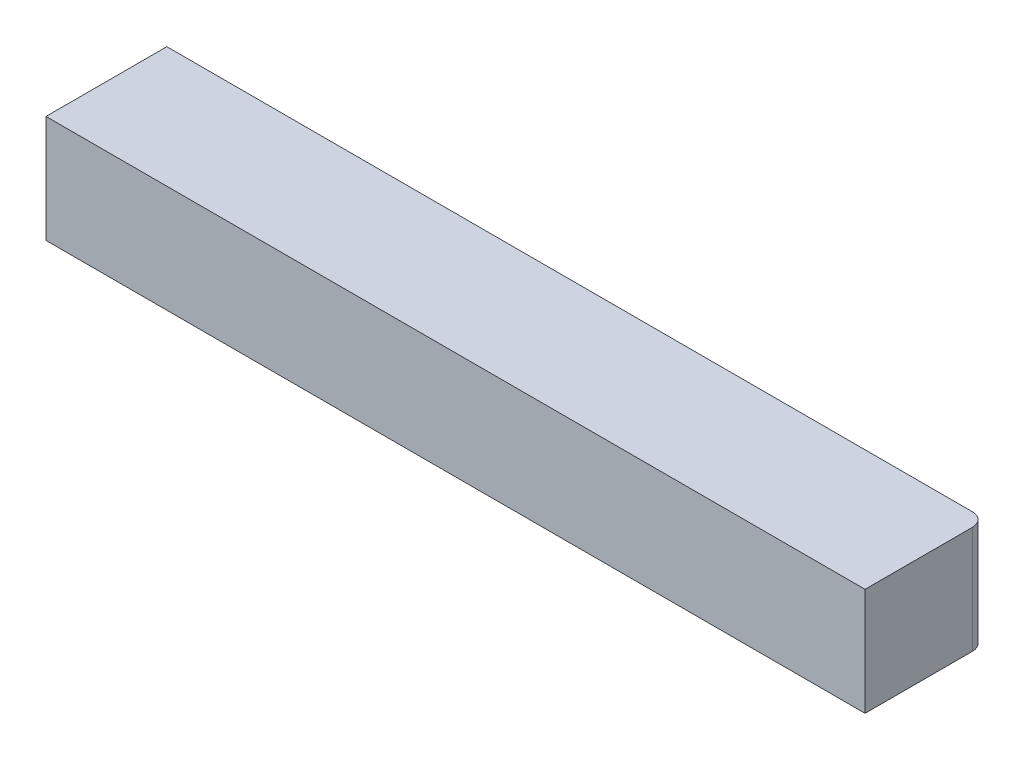
ISO-10303-21;
HEADER;
FILE_DESCRIPTION(('STEP AP214'),'2;1');
FILE_NAME('part.step','',(''),(''),'','','');
FILE_SCHEMA(('AUTOMOTIVE_DESIGN { 1 0 10303 214 1 1 1 1 }'));
ENDSEC;
DATA;
#1=APPLICATION_CONTEXT('core data for automotive mechanical design processes');
#2=APPLICATION_PROTOCOL_DEFINITION('international standard','automotive_design',2000,#1);
#3=PRODUCT_CONTEXT('',#1,'mechanical');
#4=PRODUCT('Part','Part','',(#3));
#5=PRODUCT_RELATED_PRODUCT_CATEGORY('part','',(#4));
#6=PRODUCT_DEFINITION_FORMATION('','',#4);
#7=PRODUCT_DEFINITION_CONTEXT('part definition',#1,'design');
#8=PRODUCT_DEFINITION('design','',#6,#7);
#9=PRODUCT_DEFINITION_SHAPE('','',#8);
#10=(LENGTH_UNIT() NAMED_UNIT(*) SI_UNIT(.MILLI.,.METRE.));
#11=(NAMED_UNIT(*) PLANE_ANGLE_UNIT() SI_UNIT($,.RADIAN.));
#12=(NAMED_UNIT(*) SI_UNIT($,.STERADIAN.) SOLID_ANGLE_UNIT());
#13=UNCERTAINTY_MEASURE_WITH_UNIT(LENGTH_MEASURE(1.E-05),#10,'distance_accuracy_value','');
#14=(GEOMETRIC_REPRESENTATION_CONTEXT(3) GLOBAL_UNCERTAINTY_ASSIGNED_CONTEXT((#13)) GLOBAL_UNIT_ASSIGNED_CONTEXT((#10,
#11,#12)) REPRESENTATION_CONTEXT('',''));
#15=CARTESIAN_POINT('',(0.,0.,0.));
#16=DIRECTION('',(0.,0.,1.));
#17=DIRECTION('',(1.,0.,0.));
#18=AXIS2_PLACEMENT_3D('',#15,#16,#17);
#19=CARTESIAN_POINT('',(-30.5,8.,4.5));
#20=DIRECTION('',(1.,0.,0.));
#21=DIRECTION('',(0.,0.,-1.));
#22=AXIS2_PLACEMENT_3D('',#19,#20,#21);
#23=PLANE('',#22);
#24=DIRECTION('',(0.,0.,1.));
#25=VECTOR('',#24,1.);
#26=CARTESIAN_POINT('',(-30.5,0.,4.5));
#27=LINE('',#26,#25);
#28=CARTESIAN_POINT('',(-30.5,0.,-4.5));
#29=VERTEX_POINT('',#28);
#30=CARTESIAN_POINT('',(-30.5,0.,4.5));
#31=VERTEX_POINT('',#30);
#32=EDGE_CURVE('E110',#29,#31,#27,.T.);
#33=ORIENTED_EDGE('',*,*,#32,.T.);
#34=DIRECTION('',(0.,-1.,0.));
#35=VECTOR('',#34,1.);
#36=CARTESIAN_POINT('',(-30.5,8.,4.5));
#37=LINE('',#36,#35);
#38=CARTESIAN_POINT('',(-30.5,8.,4.5));
#39=VERTEX_POINT('',#38);
#40=EDGE_CURVE('E11',#39,#31,#37,.T.);
#41=ORIENTED_EDGE('',*,*,#40,.F.);
#42=DIRECTION('',(0.,0.,1.));
#43=VECTOR('',#42,1.);
#44=CARTESIAN_POINT('',(-30.5,8.,4.5));
#45=LINE('',#44,#43);
#46=CARTESIAN_POINT('',(-30.5,8.,-4.5));
#47=VERTEX_POINT('',#46);
#48=EDGE_CURVE('E118',#47,#39,#45,.T.);
#49=ORIENTED_EDGE('',*,*,#48,.F.);
#50=DIRECTION('',(0.,-1.,0.));
#51=VECTOR('',#50,1.);
#52=CARTESIAN_POINT('',(-30.5,8.,-4.5));
#53=LINE('',#52,#51);
#54=EDGE_CURVE('E106',#47,#29,#53,.T.);
#55=ORIENTED_EDGE('',*,*,#54,.T.);
#56=EDGE_LOOP('',(#33,#41,#49,#55));
#57=FACE_BOUND('',#56,.T.);
#58=ADVANCED_FACE('F36',(#57),#23,.F.);
#59=CARTESIAN_POINT('',(-30.5,8.,4.5));
#60=DIRECTION('',(0.,0.,-1.));
#61=DIRECTION('',(-1.,0.,0.));
#62=AXIS2_PLACEMENT_3D('',#59,#60,#61);
#63=PLANE('',#62);
#64=DIRECTION('',(1.,0.,0.));
#65=VECTOR('',#64,1.);
#66=CARTESIAN_POINT('',(-30.5,0.,4.5));
#67=LINE('',#66,#65);
#68=CARTESIAN_POINT('',(30.5,0.,4.5));
#69=VERTEX_POINT('',#68);
#70=EDGE_CURVE('E113',#31,#69,#67,.T.);
#71=ORIENTED_EDGE('',*,*,#70,.T.);
#72=DIRECTION('',(0.,-1.,0.));
#73=VECTOR('',#72,1.);
#74=CARTESIAN_POINT('',(30.5,8.,4.5));
#75=LINE('',#74,#73);
#76=CARTESIAN_POINT('',(30.5,8.,4.5));
#77=VERTEX_POINT('',#76);
#78=EDGE_CURVE('E44',#77,#69,#75,.T.);
#79=ORIENTED_EDGE('',*,*,#78,.F.);
#80=DIRECTION('',(1.,0.,0.));
#81=VECTOR('',#80,1.);
#82=CARTESIAN_POINT('',(-30.5,8.,4.5));
#83=LINE('',#82,#81);
#84=EDGE_CURVE('E86',#39,#77,#83,.T.);
#85=ORIENTED_EDGE('',*,*,#84,.F.);
#86=ORIENTED_EDGE('',*,*,#40,.T.);
#87=EDGE_LOOP('',(#71,#79,#85,#86));
#88=FACE_BOUND('',#87,.T.);
#89=ADVANCED_FACE('F137',(#88),#63,.F.);
#90=CARTESIAN_POINT('',(30.5,8.,4.5));
#91=DIRECTION('',(-1.,0.,0.));
#92=DIRECTION('',(0.,0.,1.));
#93=AXIS2_PLACEMENT_3D('',#90,#91,#92);
#94=PLANE('',#93);
#95=DIRECTION('',(0.,0.,-1.));
#96=VECTOR('',#95,1.);
#97=CARTESIAN_POINT('',(30.5,0.,4.5));
#98=LINE('',#97,#96);
#99=CARTESIAN_POINT('',(30.5,0.,-3.5));
#100=VERTEX_POINT('',#99);
#101=EDGE_CURVE('E101',#69,#100,#98,.T.);
#102=ORIENTED_EDGE('',*,*,#101,.T.);
#103=DIRECTION('',(0.,-1.,0.));
#104=VECTOR('',#103,1.);
#105=CARTESIAN_POINT('',(30.5,8.,-3.5));
#106=LINE('',#105,#104);
#107=CARTESIAN_POINT('',(30.5,8.,-3.5));
#108=VERTEX_POINT('',#107);
#109=EDGE_CURVE('E98',#108,#100,#106,.T.);
#110=ORIENTED_EDGE('',*,*,#109,.F.);
#111=DIRECTION('',(0.,0.,-1.));
#112=VECTOR('',#111,1.);
#113=CARTESIAN_POINT('',(30.5,8.,4.5));
#114=LINE('',#113,#112);
#115=EDGE_CURVE('E90',#77,#108,#114,.T.);
#116=ORIENTED_EDGE('',*,*,#115,.F.);
#117=ORIENTED_EDGE('',*,*,#78,.T.);
#118=EDGE_LOOP('',(#102,#110,#116,#117));
#119=FACE_BOUND('',#118,.T.);
#120=ADVANCED_FACE('F99',(#119),#94,.F.);
#121=CARTESIAN_POINT('',(29.5,8.,-3.50000000000004));
#122=DIRECTION('',(0.,-1.,0.));
#123=DIRECTION('',(0.,0.,-1.));
#124=AXIS2_PLACEMENT_3D('',#121,#122,#123);
#125=CYLINDRICAL_SURFACE('',#124,0.999999999999967);
#126=CARTESIAN_POINT('',(29.5,0.,-3.50000000000004));
#127=DIRECTION('',(0.,1.,0.));
#128=DIRECTION('',(0.,0.,-1.));
#129=AXIS2_PLACEMENT_3D('',#126,#127,#128);
#130=CIRCLE('',#129,0.999999999999967);
#131=CARTESIAN_POINT('',(29.5,0.,-4.5));
#132=VERTEX_POINT('',#131);
#133=EDGE_CURVE('E72',#100,#132,#130,.T.);
#134=ORIENTED_EDGE('',*,*,#133,.T.);
#135=DIRECTION('',(0.,-1.,0.));
#136=VECTOR('',#135,1.);
#137=CARTESIAN_POINT('',(29.5,8.,-4.5));
#138=LINE('',#137,#136);
#139=CARTESIAN_POINT('',(29.5,8.,-4.5));
#140=VERTEX_POINT('',#139);
#141=EDGE_CURVE('E102',#140,#132,#138,.T.);
#142=ORIENTED_EDGE('',*,*,#141,.F.);
#143=CARTESIAN_POINT('',(29.5,8.,-3.50000000000004));
#144=DIRECTION('',(0.,1.,0.));
#145=DIRECTION('',(0.,0.,-1.));
#146=AXIS2_PLACEMENT_3D('',#143,#144,#145);
#147=CIRCLE('',#146,0.999999999999967);
#148=EDGE_CURVE('E94',#108,#140,#147,.T.);
#149=ORIENTED_EDGE('',*,*,#148,.F.);
#150=ORIENTED_EDGE('',*,*,#109,.T.);
#151=EDGE_LOOP('',(#134,#142,#149,#150));
#152=FACE_BOUND('',#151,.T.);
#153=ADVANCED_FACE('F104',(#152),#125,.T.);
#154=CARTESIAN_POINT('',(-30.5,8.,-4.5));
#155=DIRECTION('',(0.,0.,1.));
#156=DIRECTION('',(1.,0.,0.));
#157=AXIS2_PLACEMENT_3D('',#154,#155,#156);
#158=PLANE('',#157);
#159=DIRECTION('',(-1.,0.,0.));
#160=VECTOR('',#159,1.);
#161=CARTESIAN_POINT('',(-30.5,0.,-4.5));
#162=LINE('',#161,#160);
#163=EDGE_CURVE('E78',#132,#29,#162,.T.);
#164=ORIENTED_EDGE('',*,*,#163,.T.);
#165=ORIENTED_EDGE('',*,*,#54,.F.);
#166=DIRECTION('',(-1.,0.,0.));
#167=VECTOR('',#166,1.);
#168=CARTESIAN_POINT('',(-30.5,8.,-4.5));
#169=LINE('',#168,#167);
#170=EDGE_CURVE('E52',#140,#47,#169,.T.);
#171=ORIENTED_EDGE('',*,*,#170,.F.);
#172=ORIENTED_EDGE('',*,*,#141,.T.);
#173=EDGE_LOOP('',(#164,#165,#171,#172));
#174=FACE_BOUND('',#173,.T.);
#175=ADVANCED_FACE('F126',(#174),#158,.F.);
#176=CARTESIAN_POINT('',(29.5,8.,-3.50000000000004));
#177=DIRECTION('',(0.,-1.,0.));
#178=DIRECTION('',(0.,0.,-1.));
#179=AXIS2_PLACEMENT_3D('',#176,#177,#178);
#180=PLANE('',#179);
#181=ORIENTED_EDGE('',*,*,#48,.T.);
#182=ORIENTED_EDGE('',*,*,#84,.T.);
#183=ORIENTED_EDGE('',*,*,#115,.T.);
#184=ORIENTED_EDGE('',*,*,#148,.T.);
#185=ORIENTED_EDGE('',*,*,#170,.T.);
#186=EDGE_LOOP('',(#181,#182,#183,#184,#185));
#187=FACE_BOUND('',#186,.T.);
#188=ADVANCED_FACE('F92',(#187),#180,.F.);
#189=CARTESIAN_POINT('',(29.5,0.,-3.50000000000004));
#190=DIRECTION('',(0.,-1.,0.));
#191=DIRECTION('',(0.,0.,-1.));
#192=AXIS2_PLACEMENT_3D('',#189,#190,#191);
#193=PLANE('',#192);
#194=ORIENTED_EDGE('',*,*,#32,.F.);
#195=ORIENTED_EDGE('',*,*,#163,.F.);
#196=ORIENTED_EDGE('',*,*,#133,.F.);
#197=ORIENTED_EDGE('',*,*,#101,.F.);
#198=ORIENTED_EDGE('',*,*,#70,.F.);
#199=EDGE_LOOP('',(#194,#195,#196,#197,#198));
#200=FACE_BOUND('',#199,.T.);
#201=ADVANCED_FACE('F122',(#200),#193,.T.);
#202=CLOSED_SHELL('',(#58,#89,#120,#153,#175,#188,#201));
#203=MANIFOLD_SOLID_BREP('B2',#202);
#204=ADVANCED_BREP_SHAPE_REPRESENTATION('',(#18,#203),#14);
#205=SHAPE_DEFINITION_REPRESENTATION(#9,#204);
ENDSEC;
END-ISO-10303-21;
